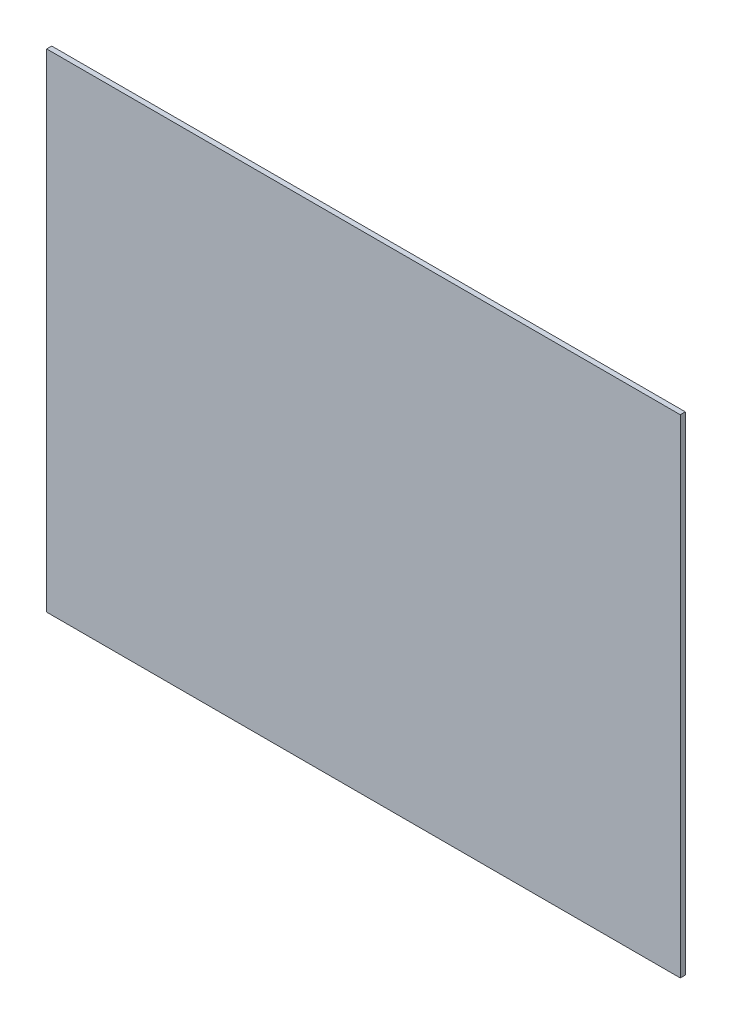
ISO-10303-21;
HEADER;
FILE_DESCRIPTION(('STEP AP214'),'2;1');
FILE_NAME('part.step','',(''),(''),'','','');
FILE_SCHEMA(('AUTOMOTIVE_DESIGN { 1 0 10303 214 1 1 1 1 }'));
ENDSEC;
DATA;
#1=APPLICATION_CONTEXT('core data for automotive mechanical design processes');
#2=APPLICATION_PROTOCOL_DEFINITION('international standard','automotive_design',2000,#1);
#3=PRODUCT_CONTEXT('',#1,'mechanical');
#4=PRODUCT('Part','Part','',(#3));
#5=PRODUCT_RELATED_PRODUCT_CATEGORY('part','',(#4));
#6=PRODUCT_DEFINITION_FORMATION('','',#4);
#7=PRODUCT_DEFINITION_CONTEXT('part definition',#1,'design');
#8=PRODUCT_DEFINITION('design','',#6,#7);
#9=PRODUCT_DEFINITION_SHAPE('','',#8);
#10=(LENGTH_UNIT() NAMED_UNIT(*) SI_UNIT(.MILLI.,.METRE.));
#11=(NAMED_UNIT(*) PLANE_ANGLE_UNIT() SI_UNIT($,.RADIAN.));
#12=(NAMED_UNIT(*) SI_UNIT($,.STERADIAN.) SOLID_ANGLE_UNIT());
#13=UNCERTAINTY_MEASURE_WITH_UNIT(LENGTH_MEASURE(1.E-05),#10,'distance_accuracy_value','');
#14=(GEOMETRIC_REPRESENTATION_CONTEXT(3) GLOBAL_UNCERTAINTY_ASSIGNED_CONTEXT((#13)) GLOBAL_UNIT_ASSIGNED_CONTEXT((#10,
#11,#12)) REPRESENTATION_CONTEXT('',''));
#15=CARTESIAN_POINT('',(0.,0.,0.));
#16=DIRECTION('',(0.,0.,1.));
#17=DIRECTION('',(1.,0.,0.));
#18=AXIS2_PLACEMENT_3D('',#15,#16,#17);
#19=CARTESIAN_POINT('',(8.8,0.3,0.05));
#20=DIRECTION('',(-1.,0.,0.));
#21=DIRECTION('',(0.,0.,1.));
#22=AXIS2_PLACEMENT_3D('',#19,#20,#21);
#23=PLANE('',#22);
#24=DIRECTION('',(0.,0.,-1.));
#25=VECTOR('',#24,1.);
#26=CARTESIAN_POINT('',(8.8,-4.55,0.05));
#27=LINE('',#26,#25);
#28=CARTESIAN_POINT('',(8.8,-4.55,0.1));
#29=VERTEX_POINT('',#28);
#30=CARTESIAN_POINT('',(8.8,-4.55,0.));
#31=VERTEX_POINT('',#30);
#32=EDGE_CURVE('E65',#29,#31,#27,.T.);
#33=ORIENTED_EDGE('',*,*,#32,.T.);
#34=DIRECTION('',(0.,-1.,0.));
#35=VECTOR('',#34,1.);
#36=CARTESIAN_POINT('',(8.8,0.3,0.));
#37=LINE('',#36,#35);
#38=CARTESIAN_POINT('',(8.8,5.15,0.));
#39=VERTEX_POINT('',#38);
#40=EDGE_CURVE('E84',#39,#31,#37,.T.);
#41=ORIENTED_EDGE('',*,*,#40,.F.);
#42=DIRECTION('',(0.,0.,-1.));
#43=VECTOR('',#42,1.);
#44=CARTESIAN_POINT('',(8.8,5.15,0.05));
#45=LINE('',#44,#43);
#46=CARTESIAN_POINT('',(8.8,5.15,0.1));
#47=VERTEX_POINT('',#46);
#48=EDGE_CURVE('E11',#47,#39,#45,.T.);
#49=ORIENTED_EDGE('',*,*,#48,.F.);
#50=DIRECTION('',(0.,1.,0.));
#51=VECTOR('',#50,1.);
#52=CARTESIAN_POINT('',(8.8,0.3,0.1));
#53=LINE('',#52,#51);
#54=EDGE_CURVE('E81',#29,#47,#53,.T.);
#55=ORIENTED_EDGE('',*,*,#54,.F.);
#56=EDGE_LOOP('',(#33,#41,#49,#55));
#57=FACE_BOUND('',#56,.T.);
#58=ADVANCED_FACE('F16',(#57),#23,.F.);
#59=CARTESIAN_POINT('',(2.5,5.15,0.05));
#60=DIRECTION('',(0.,-1.,0.));
#61=DIRECTION('',(0.,0.,-1.));
#62=AXIS2_PLACEMENT_3D('',#59,#60,#61);
#63=PLANE('',#62);
#64=ORIENTED_EDGE('',*,*,#48,.T.);
#65=DIRECTION('',(1.,0.,0.));
#66=VECTOR('',#65,1.);
#67=CARTESIAN_POINT('',(2.5,5.15,0.));
#68=LINE('',#67,#66);
#69=CARTESIAN_POINT('',(-3.8,5.15,0.));
#70=VERTEX_POINT('',#69);
#71=EDGE_CURVE('E99',#70,#39,#68,.T.);
#72=ORIENTED_EDGE('',*,*,#71,.F.);
#73=DIRECTION('',(0.,0.,-1.));
#74=VECTOR('',#73,1.);
#75=CARTESIAN_POINT('',(-3.8,5.15,0.05));
#76=LINE('',#75,#74);
#77=CARTESIAN_POINT('',(-3.8,5.15,0.1));
#78=VERTEX_POINT('',#77);
#79=EDGE_CURVE('E27',#78,#70,#76,.T.);
#80=ORIENTED_EDGE('',*,*,#79,.F.);
#81=DIRECTION('',(-1.,0.,0.));
#82=VECTOR('',#81,1.);
#83=CARTESIAN_POINT('',(2.5,5.15,0.1));
#84=LINE('',#83,#82);
#85=EDGE_CURVE('E88',#47,#78,#84,.T.);
#86=ORIENTED_EDGE('',*,*,#85,.F.);
#87=EDGE_LOOP('',(#64,#72,#80,#86));
#88=FACE_BOUND('',#87,.T.);
#89=ADVANCED_FACE('F115',(#88),#63,.F.);
#90=CARTESIAN_POINT('',(-3.8,0.3,0.05));
#91=DIRECTION('',(1.,0.,0.));
#92=DIRECTION('',(0.,1.,0.));
#93=AXIS2_PLACEMENT_3D('',#90,#91,#92);
#94=PLANE('',#93);
#95=ORIENTED_EDGE('',*,*,#79,.T.);
#96=DIRECTION('',(0.,1.,0.));
#97=VECTOR('',#96,1.);
#98=CARTESIAN_POINT('',(-3.8,0.3,0.));
#99=LINE('',#98,#97);
#100=CARTESIAN_POINT('',(-3.8,-4.55,0.));
#101=VERTEX_POINT('',#100);
#102=EDGE_CURVE('E96',#101,#70,#99,.T.);
#103=ORIENTED_EDGE('',*,*,#102,.F.);
#104=DIRECTION('',(0.,0.,-1.));
#105=VECTOR('',#104,1.);
#106=CARTESIAN_POINT('',(-3.8,-4.55,0.05));
#107=LINE('',#106,#105);
#108=CARTESIAN_POINT('',(-3.8,-4.55,0.1));
#109=VERTEX_POINT('',#108);
#110=EDGE_CURVE('E20',#109,#101,#107,.T.);
#111=ORIENTED_EDGE('',*,*,#110,.F.);
#112=DIRECTION('',(0.,-1.,0.));
#113=VECTOR('',#112,1.);
#114=CARTESIAN_POINT('',(-3.8,0.3,0.1));
#115=LINE('',#114,#113);
#116=EDGE_CURVE('E82',#78,#109,#115,.T.);
#117=ORIENTED_EDGE('',*,*,#116,.F.);
#118=EDGE_LOOP('',(#95,#103,#111,#117));
#119=FACE_BOUND('',#118,.T.);
#120=ADVANCED_FACE('F120',(#119),#94,.F.);
#121=CARTESIAN_POINT('',(2.5,-4.55,0.05));
#122=DIRECTION('',(0.,1.,0.));
#123=DIRECTION('',(1.,0.,0.));
#124=AXIS2_PLACEMENT_3D('',#121,#122,#123);
#125=PLANE('',#124);
#126=ORIENTED_EDGE('',*,*,#110,.T.);
#127=DIRECTION('',(-1.,0.,0.));
#128=VECTOR('',#127,1.);
#129=CARTESIAN_POINT('',(2.5,-4.55,0.));
#130=LINE('',#129,#128);
#131=EDGE_CURVE('E71',#31,#101,#130,.T.);
#132=ORIENTED_EDGE('',*,*,#131,.F.);
#133=ORIENTED_EDGE('',*,*,#32,.F.);
#134=DIRECTION('',(1.,0.,0.));
#135=VECTOR('',#134,1.);
#136=CARTESIAN_POINT('',(2.5,-4.55,0.1));
#137=LINE('',#136,#135);
#138=EDGE_CURVE('E68',#109,#29,#137,.T.);
#139=ORIENTED_EDGE('',*,*,#138,.F.);
#140=EDGE_LOOP('',(#126,#132,#133,#139));
#141=FACE_BOUND('',#140,.T.);
#142=ADVANCED_FACE('F67',(#141),#125,.F.);
#143=CARTESIAN_POINT('',(2.5,0.3,0.));
#144=DIRECTION('',(0.,0.,1.));
#145=DIRECTION('',(1.,0.,0.));
#146=AXIS2_PLACEMENT_3D('',#143,#144,#145);
#147=PLANE('',#146);
#148=ORIENTED_EDGE('',*,*,#40,.T.);
#149=ORIENTED_EDGE('',*,*,#131,.T.);
#150=ORIENTED_EDGE('',*,*,#102,.T.);
#151=ORIENTED_EDGE('',*,*,#71,.T.);
#152=EDGE_LOOP('',(#148,#149,#150,#151));
#153=FACE_BOUND('',#152,.T.);
#154=ADVANCED_FACE('F113',(#153),#147,.F.);
#155=CARTESIAN_POINT('',(2.5,0.3,0.1));
#156=DIRECTION('',(0.,0.,1.));
#157=DIRECTION('',(1.,0.,0.));
#158=AXIS2_PLACEMENT_3D('',#155,#156,#157);
#159=PLANE('',#158);
#160=ORIENTED_EDGE('',*,*,#54,.T.);
#161=ORIENTED_EDGE('',*,*,#85,.T.);
#162=ORIENTED_EDGE('',*,*,#116,.T.);
#163=ORIENTED_EDGE('',*,*,#138,.T.);
#164=EDGE_LOOP('',(#160,#161,#162,#163));
#165=FACE_BOUND('',#164,.T.);
#166=ADVANCED_FACE('F18',(#165),#159,.T.);
#167=CLOSED_SHELL('',(#58,#89,#120,#142,#154,#166));
#168=MANIFOLD_SOLID_BREP('B1',#167);
#169=ADVANCED_BREP_SHAPE_REPRESENTATION('',(#18,#168),#14);
#170=SHAPE_DEFINITION_REPRESENTATION(#9,#169);
ENDSEC;
END-ISO-10303-21;
